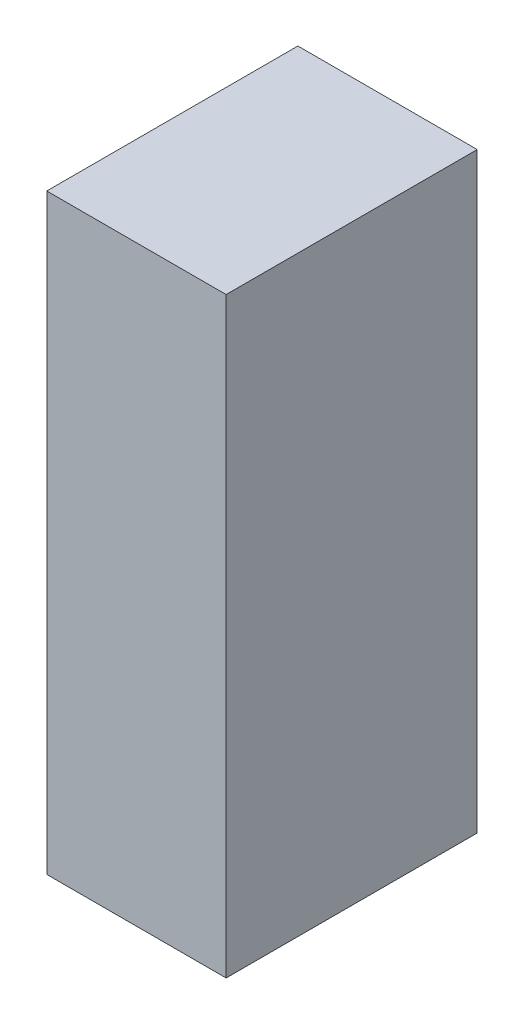
ISO-10303-21;
HEADER;
FILE_DESCRIPTION(('STEP AP214'),'2;1');
FILE_NAME('part.step','',(''),(''),'','','');
FILE_SCHEMA(('AUTOMOTIVE_DESIGN { 1 0 10303 214 1 1 1 1 }'));
ENDSEC;
DATA;
#1=APPLICATION_CONTEXT('core data for automotive mechanical design processes');
#2=APPLICATION_PROTOCOL_DEFINITION('international standard','automotive_design',2000,#1);
#3=PRODUCT_CONTEXT('',#1,'mechanical');
#4=PRODUCT('Part','Part','',(#3));
#5=PRODUCT_RELATED_PRODUCT_CATEGORY('part','',(#4));
#6=PRODUCT_DEFINITION_FORMATION('','',#4);
#7=PRODUCT_DEFINITION_CONTEXT('part definition',#1,'design');
#8=PRODUCT_DEFINITION('design','',#6,#7);
#9=PRODUCT_DEFINITION_SHAPE('','',#8);
#10=(LENGTH_UNIT() NAMED_UNIT(*) SI_UNIT(.MILLI.,.METRE.));
#11=(NAMED_UNIT(*) PLANE_ANGLE_UNIT() SI_UNIT($,.RADIAN.));
#12=(NAMED_UNIT(*) SI_UNIT($,.STERADIAN.) SOLID_ANGLE_UNIT());
#13=UNCERTAINTY_MEASURE_WITH_UNIT(LENGTH_MEASURE(1.E-05),#10,'distance_accuracy_value','');
#14=(GEOMETRIC_REPRESENTATION_CONTEXT(3) GLOBAL_UNCERTAINTY_ASSIGNED_CONTEXT((#13)) GLOBAL_UNIT_ASSIGNED_CONTEXT((#10,
#11,#12)) REPRESENTATION_CONTEXT('',''));
#15=CARTESIAN_POINT('',(0.,0.,0.));
#16=DIRECTION('',(0.,0.,1.));
#17=DIRECTION('',(1.,0.,0.));
#18=AXIS2_PLACEMENT_3D('',#15,#16,#17);
#19=CARTESIAN_POINT('',(1.12499591802136,-0.824986940283623,-2.84112203121185));
#20=DIRECTION('',(-4.37113882867379E-08,-1.,0.));
#21=DIRECTION('',(1.,-4.37113882867379E-08,0.));
#22=AXIS2_PLACEMENT_3D('',#19,#20,#21);
#23=PLANE('',#22);
#24=DIRECTION('',(0.999999999999999,-4.37113882867379E-08,0.));
#25=VECTOR('',#24,1.);
#26=CARTESIAN_POINT('',(1.12499591802136,-0.824986940283623,-2.84112203121185));
#27=LINE('',#26,#25);
#28=CARTESIAN_POINT('',(1.12499591802136,-0.824986940283623,-2.84112203121185));
#29=VERTEX_POINT('',#28);
#30=CARTESIAN_POINT('',(1.62499591802136,-0.824986962139349,-2.84112203121185));
#31=VERTEX_POINT('',#30);
#32=EDGE_CURVE('E11',#29,#31,#27,.T.);
#33=ORIENTED_EDGE('',*,*,#32,.T.);
#34=DIRECTION('',(0.,0.,1.));
#35=VECTOR('',#34,1.);
#36=CARTESIAN_POINT('',(1.62499591802136,-0.824986962139317,-2.84112203121185));
#37=LINE('',#36,#35);
#38=CARTESIAN_POINT('',(1.62499591802136,-0.824986962139349,-2.14112091064453));
#39=VERTEX_POINT('',#38);
#40=EDGE_CURVE('E88',#31,#39,#37,.T.);
#41=ORIENTED_EDGE('',*,*,#40,.T.);
#42=DIRECTION('',(0.999999999999999,-4.37113882867379E-08,0.));
#43=VECTOR('',#42,1.);
#44=CARTESIAN_POINT('',(1.12499591802136,-0.824986940283623,-2.14112091064453));
#45=LINE('',#44,#43);
#46=CARTESIAN_POINT('',(1.12499591802136,-0.824986940283623,-2.14112091064453));
#47=VERTEX_POINT('',#46);
#48=EDGE_CURVE('E83',#47,#39,#45,.T.);
#49=ORIENTED_EDGE('',*,*,#48,.F.);
#50=DIRECTION('',(0.,0.,1.));
#51=VECTOR('',#50,1.);
#52=CARTESIAN_POINT('',(1.12499591802136,-0.824986940283622,-2.84112203121185));
#53=LINE('',#52,#51);
#54=EDGE_CURVE('E72',#29,#47,#53,.T.);
#55=ORIENTED_EDGE('',*,*,#54,.F.);
#56=EDGE_LOOP('',(#33,#41,#49,#55));
#57=FACE_BOUND('',#56,.T.);
#58=ADVANCED_FACE('F17',(#57),#23,.T.);
#59=CARTESIAN_POINT('',(1.62499591802136,-0.824986962139349,-2.84112203121185));
#60=DIRECTION('',(1.,-4.37113882867379E-08,0.));
#61=DIRECTION('',(4.37113882867379E-08,1.,0.));
#62=AXIS2_PLACEMENT_3D('',#59,#60,#61);
#63=PLANE('',#62);
#64=DIRECTION('',(4.37113882503349E-08,0.999999999999999,0.));
#65=VECTOR('',#64,1.);
#66=CARTESIAN_POINT('',(1.62499591802136,-0.824986962139349,-2.84112203121185));
#67=LINE('',#66,#65);
#68=CARTESIAN_POINT('',(1.62499599014488,0.825006934345026,-2.84112203121185));
#69=VERTEX_POINT('',#68);
#70=EDGE_CURVE('E24',#31,#69,#67,.T.);
#71=ORIENTED_EDGE('',*,*,#70,.T.);
#72=DIRECTION('',(0.,0.,1.));
#73=VECTOR('',#72,1.);
#74=CARTESIAN_POINT('',(1.62499599014488,0.825006934345026,-2.84112203121185));
#75=LINE('',#74,#73);
#76=CARTESIAN_POINT('',(1.62499599014488,0.825006934345026,-2.14112091064453));
#77=VERTEX_POINT('',#76);
#78=EDGE_CURVE('E85',#69,#77,#75,.T.);
#79=ORIENTED_EDGE('',*,*,#78,.T.);
#80=DIRECTION('',(4.37113882503349E-08,0.999999999999999,0.));
#81=VECTOR('',#80,1.);
#82=CARTESIAN_POINT('',(1.62499591802136,-0.824986962139349,-2.14112091064453));
#83=LINE('',#82,#81);
#84=EDGE_CURVE('E66',#39,#77,#83,.T.);
#85=ORIENTED_EDGE('',*,*,#84,.F.);
#86=ORIENTED_EDGE('',*,*,#40,.F.);
#87=EDGE_LOOP('',(#71,#79,#85,#86));
#88=FACE_BOUND('',#87,.T.);
#89=ADVANCED_FACE('F89',(#88),#63,.T.);
#90=CARTESIAN_POINT('',(1.62499599014488,0.825006934345026,-2.84112203121185));
#91=DIRECTION('',(4.37113882867379E-08,1.,0.));
#92=DIRECTION('',(-1.,4.37113882867379E-08,0.));
#93=AXIS2_PLACEMENT_3D('',#90,#91,#92);
#94=PLANE('',#93);
#95=DIRECTION('',(-0.999999999999999,4.37113882867379E-08,0.));
#96=VECTOR('',#95,1.);
#97=CARTESIAN_POINT('',(1.62499599014488,0.825006934345026,-2.84112203121185));
#98=LINE('',#97,#96);
#99=CARTESIAN_POINT('',(1.12499599014488,0.825006956200752,-2.84112203121185));
#100=VERTEX_POINT('',#99);
#101=EDGE_CURVE('E62',#69,#100,#98,.T.);
#102=ORIENTED_EDGE('',*,*,#101,.T.);
#103=DIRECTION('',(0.,0.,1.));
#104=VECTOR('',#103,1.);
#105=CARTESIAN_POINT('',(1.12499599014488,0.82500695620072,-2.84112203121185));
#106=LINE('',#105,#104);
#107=CARTESIAN_POINT('',(1.12499599014488,0.825006956200752,-2.14112091064453));
#108=VERTEX_POINT('',#107);
#109=EDGE_CURVE('E55',#100,#108,#106,.T.);
#110=ORIENTED_EDGE('',*,*,#109,.T.);
#111=DIRECTION('',(-0.999999999999999,4.37113882867379E-08,0.));
#112=VECTOR('',#111,1.);
#113=CARTESIAN_POINT('',(1.62499599014488,0.825006934345026,-2.14112091064453));
#114=LINE('',#113,#112);
#115=EDGE_CURVE('E59',#77,#108,#114,.T.);
#116=ORIENTED_EDGE('',*,*,#115,.F.);
#117=ORIENTED_EDGE('',*,*,#78,.F.);
#118=EDGE_LOOP('',(#102,#110,#116,#117));
#119=FACE_BOUND('',#118,.T.);
#120=ADVANCED_FACE('F57',(#119),#94,.T.);
#121=CARTESIAN_POINT('',(1.12499599014488,0.825006956200752,-2.84112203121185));
#122=DIRECTION('',(-1.,4.37113882867379E-08,0.));
#123=DIRECTION('',(-4.37113882867379E-08,-1.,0.));
#124=AXIS2_PLACEMENT_3D('',#121,#122,#123);
#125=PLANE('',#124);
#126=DIRECTION('',(-4.37113882503349E-08,-0.999999999999999,0.));
#127=VECTOR('',#126,1.);
#128=CARTESIAN_POINT('',(1.12499599014488,0.825006956200752,-2.84112203121185));
#129=LINE('',#128,#127);
#130=EDGE_CURVE('E65',#100,#29,#129,.T.);
#131=ORIENTED_EDGE('',*,*,#130,.T.);
#132=ORIENTED_EDGE('',*,*,#54,.T.);
#133=DIRECTION('',(-4.37113882503349E-08,-0.999999999999999,0.));
#134=VECTOR('',#133,1.);
#135=CARTESIAN_POINT('',(1.12499599014488,0.825006956200752,-2.14112091064453));
#136=LINE('',#135,#134);
#137=EDGE_CURVE('E70',#108,#47,#136,.T.);
#138=ORIENTED_EDGE('',*,*,#137,.F.);
#139=ORIENTED_EDGE('',*,*,#109,.F.);
#140=EDGE_LOOP('',(#131,#132,#138,#139));
#141=FACE_BOUND('',#140,.T.);
#142=ADVANCED_FACE('F71',(#141),#125,.T.);
#143=CARTESIAN_POINT('',(-118.999992370605,267.100006103516,-2.14112091064453));
#144=DIRECTION('',(0.,0.,1.));
#145=DIRECTION('',(-4.37113882867379E-08,-1.,0.));
#146=AXIS2_PLACEMENT_3D('',#143,#144,#145);
#147=PLANE('',#146);
#148=ORIENTED_EDGE('',*,*,#48,.T.);
#149=ORIENTED_EDGE('',*,*,#84,.T.);
#150=ORIENTED_EDGE('',*,*,#115,.T.);
#151=ORIENTED_EDGE('',*,*,#137,.T.);
#152=EDGE_LOOP('',(#148,#149,#150,#151));
#153=FACE_BOUND('',#152,.T.);
#154=ADVANCED_FACE('F76',(#153),#147,.T.);
#155=CARTESIAN_POINT('',(-118.999992370605,267.100006103516,-2.84112203121185));
#156=DIRECTION('',(0.,0.,1.));
#157=DIRECTION('',(-4.37113882867379E-08,-1.,0.));
#158=AXIS2_PLACEMENT_3D('',#155,#156,#157);
#159=PLANE('',#158);
#160=ORIENTED_EDGE('',*,*,#130,.F.);
#161=ORIENTED_EDGE('',*,*,#101,.F.);
#162=ORIENTED_EDGE('',*,*,#70,.F.);
#163=ORIENTED_EDGE('',*,*,#32,.F.);
#164=EDGE_LOOP('',(#160,#161,#162,#163));
#165=FACE_BOUND('',#164,.T.);
#166=ADVANCED_FACE('F91',(#165),#159,.F.);
#167=CLOSED_SHELL('',(#58,#89,#120,#142,#154,#166));
#168=MANIFOLD_SOLID_BREP('B1',#167);
#169=ADVANCED_BREP_SHAPE_REPRESENTATION('',(#18,#168),#14);
#170=SHAPE_DEFINITION_REPRESENTATION(#9,#169);
ENDSEC;
END-ISO-10303-21;
